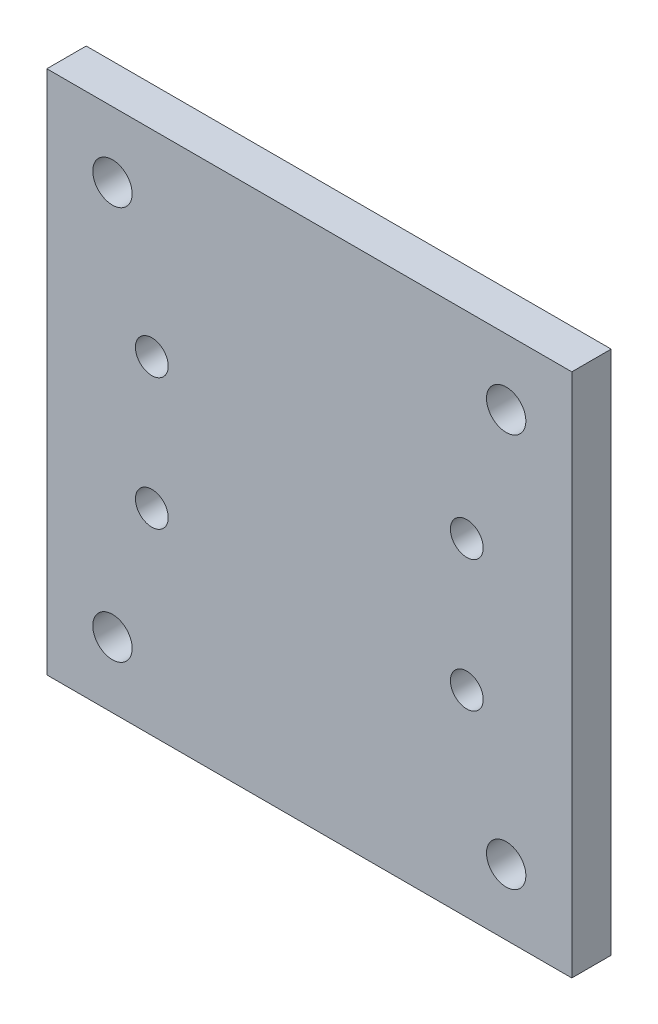
ISO-10303-21;
HEADER;
FILE_DESCRIPTION(('STEP AP214'),'2;1');
FILE_NAME('part.step','',(''),(''),'','','');
FILE_SCHEMA(('AUTOMOTIVE_DESIGN { 1 0 10303 214 1 1 1 1 }'));
ENDSEC;
DATA;
#1=APPLICATION_CONTEXT('core data for automotive mechanical design processes');
#2=APPLICATION_PROTOCOL_DEFINITION('international standard','automotive_design',2000,#1);
#3=PRODUCT_CONTEXT('',#1,'mechanical');
#4=PRODUCT('Part','Part','',(#3));
#5=PRODUCT_RELATED_PRODUCT_CATEGORY('part','',(#4));
#6=PRODUCT_DEFINITION_FORMATION('','',#4);
#7=PRODUCT_DEFINITION_CONTEXT('part definition',#1,'design');
#8=PRODUCT_DEFINITION('design','',#6,#7);
#9=PRODUCT_DEFINITION_SHAPE('','',#8);
#10=(LENGTH_UNIT() NAMED_UNIT(*) SI_UNIT(.MILLI.,.METRE.));
#11=(NAMED_UNIT(*) PLANE_ANGLE_UNIT() SI_UNIT($,.RADIAN.));
#12=(NAMED_UNIT(*) SI_UNIT($,.STERADIAN.) SOLID_ANGLE_UNIT());
#13=UNCERTAINTY_MEASURE_WITH_UNIT(LENGTH_MEASURE(1.E-05),#10,'distance_accuracy_value','');
#14=(GEOMETRIC_REPRESENTATION_CONTEXT(3) GLOBAL_UNCERTAINTY_ASSIGNED_CONTEXT((#13)) GLOBAL_UNIT_ASSIGNED_CONTEXT((#10,
#11,#12)) REPRESENTATION_CONTEXT('',''));
#15=CARTESIAN_POINT('',(0.,0.,0.));
#16=DIRECTION('',(0.,0.,1.));
#17=DIRECTION('',(1.,0.,0.));
#18=AXIS2_PLACEMENT_3D('',#15,#16,#17);
#19=CARTESIAN_POINT('',(20.,20.,3.));
#20=DIRECTION('',(0.,0.,-1.));
#21=DIRECTION('',(-1.,0.,0.));
#22=AXIS2_PLACEMENT_3D('',#19,#20,#21);
#23=PLANE('',#22);
#24=CARTESIAN_POINT('',(12.,-5.,3.));
#25=DIRECTION('',(0.,0.,1.));
#26=DIRECTION('',(1.,0.,0.));
#27=AXIS2_PLACEMENT_3D('',#24,#25,#26);
#28=CIRCLE('',#27,1.25);
#29=CARTESIAN_POINT('',(13.25,-5.,3.));
#30=VERTEX_POINT('',#29);
#31=EDGE_CURVE('E145',#30,#30,#28,.T.);
#32=ORIENTED_EDGE('',*,*,#31,.F.);
#33=EDGE_LOOP('',(#32));
#34=FACE_BOUND('',#33,.T.);
#35=CARTESIAN_POINT('',(-12.,5.,3.));
#36=DIRECTION('',(0.,0.,1.));
#37=DIRECTION('',(1.,0.,0.));
#38=AXIS2_PLACEMENT_3D('',#35,#36,#37);
#39=CIRCLE('',#38,1.25);
#40=CARTESIAN_POINT('',(-10.75,5.,3.));
#41=VERTEX_POINT('',#40);
#42=EDGE_CURVE('E133',#41,#41,#39,.T.);
#43=ORIENTED_EDGE('',*,*,#42,.F.);
#44=EDGE_LOOP('',(#43));
#45=FACE_BOUND('',#44,.T.);
#46=CARTESIAN_POINT('',(15.,-15.,3.));
#47=DIRECTION('',(0.,0.,1.));
#48=DIRECTION('',(1.,0.,0.));
#49=AXIS2_PLACEMENT_3D('',#46,#47,#48);
#50=CIRCLE('',#49,1.5);
#51=CARTESIAN_POINT('',(16.5,-15.,3.));
#52=VERTEX_POINT('',#51);
#53=EDGE_CURVE('E121',#52,#52,#50,.T.);
#54=ORIENTED_EDGE('',*,*,#53,.F.);
#55=EDGE_LOOP('',(#54));
#56=FACE_BOUND('',#55,.T.);
#57=CARTESIAN_POINT('',(-15.,15.,3.));
#58=DIRECTION('',(0.,0.,1.));
#59=DIRECTION('',(1.,0.,0.));
#60=AXIS2_PLACEMENT_3D('',#57,#58,#59);
#61=CIRCLE('',#60,1.5);
#62=CARTESIAN_POINT('',(-13.5,15.,3.));
#63=VERTEX_POINT('',#62);
#64=EDGE_CURVE('E100',#63,#63,#61,.T.);
#65=ORIENTED_EDGE('',*,*,#64,.F.);
#66=EDGE_LOOP('',(#65));
#67=FACE_BOUND('',#66,.T.);
#68=DIRECTION('',(0.,1.,0.));
#69=VECTOR('',#68,1.);
#70=CARTESIAN_POINT('',(20.,-20.,3.));
#71=LINE('',#70,#69);
#72=CARTESIAN_POINT('',(20.,-20.,3.));
#73=VERTEX_POINT('',#72);
#74=CARTESIAN_POINT('',(20.,20.,3.));
#75=VERTEX_POINT('',#74);
#76=EDGE_CURVE('E85',#73,#75,#71,.T.);
#77=ORIENTED_EDGE('',*,*,#76,.T.);
#78=DIRECTION('',(-1.,0.,0.));
#79=VECTOR('',#78,1.);
#80=CARTESIAN_POINT('',(-20.,20.,3.));
#81=LINE('',#80,#79);
#82=CARTESIAN_POINT('',(-20.,20.,3.));
#83=VERTEX_POINT('',#82);
#84=EDGE_CURVE('E80',#75,#83,#81,.T.);
#85=ORIENTED_EDGE('',*,*,#84,.T.);
#86=DIRECTION('',(0.,-1.,0.));
#87=VECTOR('',#86,1.);
#88=CARTESIAN_POINT('',(-20.,-20.,3.));
#89=LINE('',#88,#87);
#90=CARTESIAN_POINT('',(-20.,-20.,3.));
#91=VERTEX_POINT('',#90);
#92=EDGE_CURVE('E83',#83,#91,#89,.T.);
#93=ORIENTED_EDGE('',*,*,#92,.T.);
#94=DIRECTION('',(1.,0.,0.));
#95=VECTOR('',#94,1.);
#96=CARTESIAN_POINT('',(-20.,-20.,3.));
#97=LINE('',#96,#95);
#98=EDGE_CURVE('E50',#91,#73,#97,.T.);
#99=ORIENTED_EDGE('',*,*,#98,.T.);
#100=EDGE_LOOP('',(#77,#85,#93,#99));
#101=FACE_BOUND('',#100,.T.);
#102=CARTESIAN_POINT('',(15.,15.,3.));
#103=DIRECTION('',(0.,0.,1.));
#104=DIRECTION('',(-1.,0.,0.));
#105=AXIS2_PLACEMENT_3D('',#102,#103,#104);
#106=CIRCLE('',#105,1.5);
#107=CARTESIAN_POINT('',(13.5,15.,3.));
#108=VERTEX_POINT('',#107);
#109=EDGE_CURVE('E115',#108,#108,#106,.T.);
#110=ORIENTED_EDGE('',*,*,#109,.F.);
#111=EDGE_LOOP('',(#110));
#112=FACE_BOUND('',#111,.T.);
#113=CARTESIAN_POINT('',(-15.,-15.,3.));
#114=DIRECTION('',(0.,0.,1.));
#115=DIRECTION('',(-1.,0.,0.));
#116=AXIS2_PLACEMENT_3D('',#113,#114,#115);
#117=CIRCLE('',#116,1.5);
#118=CARTESIAN_POINT('',(-16.5,-15.,3.));
#119=VERTEX_POINT('',#118);
#120=EDGE_CURVE('E127',#119,#119,#117,.T.);
#121=ORIENTED_EDGE('',*,*,#120,.F.);
#122=EDGE_LOOP('',(#121));
#123=FACE_BOUND('',#122,.T.);
#124=CARTESIAN_POINT('',(-12.,-5.,3.));
#125=DIRECTION('',(0.,0.,1.));
#126=DIRECTION('',(-1.,0.,0.));
#127=AXIS2_PLACEMENT_3D('',#124,#125,#126);
#128=CIRCLE('',#127,1.25);
#129=CARTESIAN_POINT('',(-13.25,-5.,3.));
#130=VERTEX_POINT('',#129);
#131=EDGE_CURVE('E139',#130,#130,#128,.T.);
#132=ORIENTED_EDGE('',*,*,#131,.F.);
#133=EDGE_LOOP('',(#132));
#134=FACE_BOUND('',#133,.T.);
#135=CARTESIAN_POINT('',(12.,5.,3.));
#136=DIRECTION('',(0.,0.,1.));
#137=DIRECTION('',(-1.,0.,0.));
#138=AXIS2_PLACEMENT_3D('',#135,#136,#137);
#139=CIRCLE('',#138,1.25);
#140=CARTESIAN_POINT('',(10.75,5.,3.));
#141=VERTEX_POINT('',#140);
#142=EDGE_CURVE('E151',#141,#141,#139,.T.);
#143=ORIENTED_EDGE('',*,*,#142,.F.);
#144=EDGE_LOOP('',(#143));
#145=FACE_BOUND('',#144,.T.);
#146=ADVANCED_FACE('F33',(#34,#45,#56,#67,#101,#112,#123,#134,#145),#23,.F.);
#147=CARTESIAN_POINT('',(20.,20.,0.));
#148=DIRECTION('',(0.,0.,-1.));
#149=DIRECTION('',(-1.,0.,0.));
#150=AXIS2_PLACEMENT_3D('',#147,#148,#149);
#151=PLANE('',#150);
#152=CARTESIAN_POINT('',(12.,-5.,0.));
#153=DIRECTION('',(0.,0.,1.));
#154=DIRECTION('',(1.,0.,0.));
#155=AXIS2_PLACEMENT_3D('',#152,#153,#154);
#156=CIRCLE('',#155,1.25);
#157=CARTESIAN_POINT('',(13.25,-5.,0.));
#158=VERTEX_POINT('',#157);
#159=EDGE_CURVE('E148',#158,#158,#156,.T.);
#160=ORIENTED_EDGE('',*,*,#159,.T.);
#161=EDGE_LOOP('',(#160));
#162=FACE_BOUND('',#161,.T.);
#163=CARTESIAN_POINT('',(-12.,5.,0.));
#164=DIRECTION('',(0.,0.,1.));
#165=DIRECTION('',(1.,0.,0.));
#166=AXIS2_PLACEMENT_3D('',#163,#164,#165);
#167=CIRCLE('',#166,1.25);
#168=CARTESIAN_POINT('',(-10.75,5.,0.));
#169=VERTEX_POINT('',#168);
#170=EDGE_CURVE('E136',#169,#169,#167,.T.);
#171=ORIENTED_EDGE('',*,*,#170,.T.);
#172=EDGE_LOOP('',(#171));
#173=FACE_BOUND('',#172,.T.);
#174=CARTESIAN_POINT('',(15.,-15.,0.));
#175=DIRECTION('',(0.,0.,1.));
#176=DIRECTION('',(1.,0.,0.));
#177=AXIS2_PLACEMENT_3D('',#174,#175,#176);
#178=CIRCLE('',#177,1.5);
#179=CARTESIAN_POINT('',(16.5,-15.,0.));
#180=VERTEX_POINT('',#179);
#181=EDGE_CURVE('E124',#180,#180,#178,.T.);
#182=ORIENTED_EDGE('',*,*,#181,.T.);
#183=EDGE_LOOP('',(#182));
#184=FACE_BOUND('',#183,.T.);
#185=CARTESIAN_POINT('',(-15.,15.,0.));
#186=DIRECTION('',(0.,0.,1.));
#187=DIRECTION('',(1.,0.,0.));
#188=AXIS2_PLACEMENT_3D('',#185,#186,#187);
#189=CIRCLE('',#188,1.5);
#190=CARTESIAN_POINT('',(-13.5,15.,0.));
#191=VERTEX_POINT('',#190);
#192=EDGE_CURVE('E112',#191,#191,#189,.T.);
#193=ORIENTED_EDGE('',*,*,#192,.T.);
#194=EDGE_LOOP('',(#193));
#195=FACE_BOUND('',#194,.T.);
#196=DIRECTION('',(0.,1.,0.));
#197=VECTOR('',#196,1.);
#198=CARTESIAN_POINT('',(20.,-20.,0.));
#199=LINE('',#198,#197);
#200=CARTESIAN_POINT('',(20.,-20.,0.));
#201=VERTEX_POINT('',#200);
#202=CARTESIAN_POINT('',(20.,20.,0.));
#203=VERTEX_POINT('',#202);
#204=EDGE_CURVE('E97',#201,#203,#199,.T.);
#205=ORIENTED_EDGE('',*,*,#204,.F.);
#206=DIRECTION('',(1.,0.,0.));
#207=VECTOR('',#206,1.);
#208=CARTESIAN_POINT('',(-20.,-20.,0.));
#209=LINE('',#208,#207);
#210=CARTESIAN_POINT('',(-20.,-20.,0.));
#211=VERTEX_POINT('',#210);
#212=EDGE_CURVE('E73',#211,#201,#209,.T.);
#213=ORIENTED_EDGE('',*,*,#212,.F.);
#214=DIRECTION('',(0.,-1.,0.));
#215=VECTOR('',#214,1.);
#216=CARTESIAN_POINT('',(-20.,-20.,0.));
#217=LINE('',#216,#215);
#218=CARTESIAN_POINT('',(-20.,20.,0.));
#219=VERTEX_POINT('',#218);
#220=EDGE_CURVE('E67',#219,#211,#217,.T.);
#221=ORIENTED_EDGE('',*,*,#220,.F.);
#222=DIRECTION('',(-1.,0.,0.));
#223=VECTOR('',#222,1.);
#224=CARTESIAN_POINT('',(-20.,20.,0.));
#225=LINE('',#224,#223);
#226=EDGE_CURVE('E89',#203,#219,#225,.T.);
#227=ORIENTED_EDGE('',*,*,#226,.F.);
#228=EDGE_LOOP('',(#205,#213,#221,#227));
#229=FACE_BOUND('',#228,.T.);
#230=CARTESIAN_POINT('',(15.,15.,0.));
#231=DIRECTION('',(0.,0.,1.));
#232=DIRECTION('',(-1.,0.,0.));
#233=AXIS2_PLACEMENT_3D('',#230,#231,#232);
#234=CIRCLE('',#233,1.5);
#235=CARTESIAN_POINT('',(13.5,15.,0.));
#236=VERTEX_POINT('',#235);
#237=EDGE_CURVE('E118',#236,#236,#234,.T.);
#238=ORIENTED_EDGE('',*,*,#237,.T.);
#239=EDGE_LOOP('',(#238));
#240=FACE_BOUND('',#239,.T.);
#241=CARTESIAN_POINT('',(-15.,-15.,0.));
#242=DIRECTION('',(0.,0.,1.));
#243=DIRECTION('',(-1.,0.,0.));
#244=AXIS2_PLACEMENT_3D('',#241,#242,#243);
#245=CIRCLE('',#244,1.5);
#246=CARTESIAN_POINT('',(-16.5,-15.,0.));
#247=VERTEX_POINT('',#246);
#248=EDGE_CURVE('E130',#247,#247,#245,.T.);
#249=ORIENTED_EDGE('',*,*,#248,.T.);
#250=EDGE_LOOP('',(#249));
#251=FACE_BOUND('',#250,.T.);
#252=CARTESIAN_POINT('',(-12.,-5.,0.));
#253=DIRECTION('',(0.,0.,1.));
#254=DIRECTION('',(-1.,0.,0.));
#255=AXIS2_PLACEMENT_3D('',#252,#253,#254);
#256=CIRCLE('',#255,1.25);
#257=CARTESIAN_POINT('',(-13.25,-5.,0.));
#258=VERTEX_POINT('',#257);
#259=EDGE_CURVE('E142',#258,#258,#256,.T.);
#260=ORIENTED_EDGE('',*,*,#259,.T.);
#261=EDGE_LOOP('',(#260));
#262=FACE_BOUND('',#261,.T.);
#263=CARTESIAN_POINT('',(12.,5.,0.));
#264=DIRECTION('',(0.,0.,1.));
#265=DIRECTION('',(-1.,0.,0.));
#266=AXIS2_PLACEMENT_3D('',#263,#264,#265);
#267=CIRCLE('',#266,1.25);
#268=CARTESIAN_POINT('',(10.75,5.,0.));
#269=VERTEX_POINT('',#268);
#270=EDGE_CURVE('E154',#269,#269,#267,.T.);
#271=ORIENTED_EDGE('',*,*,#270,.T.);
#272=EDGE_LOOP('',(#271));
#273=FACE_BOUND('',#272,.T.);
#274=ADVANCED_FACE('F108',(#162,#173,#184,#195,#229,#240,#251,#262,#273),#151,.T.);
#275=CARTESIAN_POINT('',(20.,-20.,3.));
#276=DIRECTION('',(-1.,0.,0.));
#277=DIRECTION('',(0.,0.,1.));
#278=AXIS2_PLACEMENT_3D('',#275,#276,#277);
#279=PLANE('',#278);
#280=ORIENTED_EDGE('',*,*,#204,.T.);
#281=DIRECTION('',(0.,0.,-1.));
#282=VECTOR('',#281,1.);
#283=CARTESIAN_POINT('',(20.,20.,3.));
#284=LINE('',#283,#282);
#285=EDGE_CURVE('E11',#75,#203,#284,.T.);
#286=ORIENTED_EDGE('',*,*,#285,.F.);
#287=ORIENTED_EDGE('',*,*,#76,.F.);
#288=DIRECTION('',(0.,0.,-1.));
#289=VECTOR('',#288,1.);
#290=CARTESIAN_POINT('',(20.,-20.,3.));
#291=LINE('',#290,#289);
#292=EDGE_CURVE('E93',#73,#201,#291,.T.);
#293=ORIENTED_EDGE('',*,*,#292,.T.);
#294=EDGE_LOOP('',(#280,#286,#287,#293));
#295=FACE_BOUND('',#294,.T.);
#296=ADVANCED_FACE('F35',(#295),#279,.F.);
#297=CARTESIAN_POINT('',(-20.,20.,3.));
#298=DIRECTION('',(0.,-1.,0.));
#299=DIRECTION('',(0.,0.,-1.));
#300=AXIS2_PLACEMENT_3D('',#297,#298,#299);
#301=PLANE('',#300);
#302=ORIENTED_EDGE('',*,*,#226,.T.);
#303=DIRECTION('',(0.,0.,-1.));
#304=VECTOR('',#303,1.);
#305=CARTESIAN_POINT('',(-20.,20.,3.));
#306=LINE('',#305,#304);
#307=EDGE_CURVE('E42',#83,#219,#306,.T.);
#308=ORIENTED_EDGE('',*,*,#307,.F.);
#309=ORIENTED_EDGE('',*,*,#84,.F.);
#310=ORIENTED_EDGE('',*,*,#285,.T.);
#311=EDGE_LOOP('',(#302,#308,#309,#310));
#312=FACE_BOUND('',#311,.T.);
#313=ADVANCED_FACE('F88',(#312),#301,.F.);
#314=CARTESIAN_POINT('',(-20.,-20.,3.));
#315=DIRECTION('',(1.,0.,0.));
#316=DIRECTION('',(0.,0.,-1.));
#317=AXIS2_PLACEMENT_3D('',#314,#315,#316);
#318=PLANE('',#317);
#319=ORIENTED_EDGE('',*,*,#220,.T.);
#320=DIRECTION('',(0.,0.,-1.));
#321=VECTOR('',#320,1.);
#322=CARTESIAN_POINT('',(-20.,-20.,3.));
#323=LINE('',#322,#321);
#324=EDGE_CURVE('E90',#91,#211,#323,.T.);
#325=ORIENTED_EDGE('',*,*,#324,.F.);
#326=ORIENTED_EDGE('',*,*,#92,.F.);
#327=ORIENTED_EDGE('',*,*,#307,.T.);
#328=EDGE_LOOP('',(#319,#325,#326,#327));
#329=FACE_BOUND('',#328,.T.);
#330=ADVANCED_FACE('F91',(#329),#318,.F.);
#331=CARTESIAN_POINT('',(-20.,-20.,3.));
#332=DIRECTION('',(0.,1.,0.));
#333=DIRECTION('',(0.,0.,1.));
#334=AXIS2_PLACEMENT_3D('',#331,#332,#333);
#335=PLANE('',#334);
#336=ORIENTED_EDGE('',*,*,#212,.T.);
#337=ORIENTED_EDGE('',*,*,#292,.F.);
#338=ORIENTED_EDGE('',*,*,#98,.F.);
#339=ORIENTED_EDGE('',*,*,#324,.T.);
#340=EDGE_LOOP('',(#336,#337,#338,#339));
#341=FACE_BOUND('',#340,.T.);
#342=ADVANCED_FACE('F105',(#341),#335,.F.);
#343=CARTESIAN_POINT('',(-15.,15.,3.));
#344=DIRECTION('',(0.,0.,-1.));
#345=DIRECTION('',(-1.,0.,0.));
#346=AXIS2_PLACEMENT_3D('',#343,#344,#345);
#347=CYLINDRICAL_SURFACE('',#346,1.5);
#348=ORIENTED_EDGE('',*,*,#64,.T.);
#349=EDGE_LOOP('',(#348));
#350=FACE_BOUND('',#349,.T.);
#351=ORIENTED_EDGE('',*,*,#192,.F.);
#352=EDGE_LOOP('',(#351));
#353=FACE_BOUND('',#352,.T.);
#354=ADVANCED_FACE('F174',(#350,#353),#347,.F.);
#355=CARTESIAN_POINT('',(15.,15.,3.));
#356=DIRECTION('',(0.,0.,-1.));
#357=DIRECTION('',(-1.,0.,0.));
#358=AXIS2_PLACEMENT_3D('',#355,#356,#357);
#359=CYLINDRICAL_SURFACE('',#358,1.5);
#360=ORIENTED_EDGE('',*,*,#109,.T.);
#361=EDGE_LOOP('',(#360));
#362=FACE_BOUND('',#361,.T.);
#363=ORIENTED_EDGE('',*,*,#237,.F.);
#364=EDGE_LOOP('',(#363));
#365=FACE_BOUND('',#364,.T.);
#366=ADVANCED_FACE('F220',(#362,#365),#359,.F.);
#367=CARTESIAN_POINT('',(15.,-15.,3.));
#368=DIRECTION('',(0.,0.,-1.));
#369=DIRECTION('',(-1.,0.,0.));
#370=AXIS2_PLACEMENT_3D('',#367,#368,#369);
#371=CYLINDRICAL_SURFACE('',#370,1.5);
#372=ORIENTED_EDGE('',*,*,#53,.T.);
#373=EDGE_LOOP('',(#372));
#374=FACE_BOUND('',#373,.T.);
#375=ORIENTED_EDGE('',*,*,#181,.F.);
#376=EDGE_LOOP('',(#375));
#377=FACE_BOUND('',#376,.T.);
#378=ADVANCED_FACE('F228',(#374,#377),#371,.F.);
#379=CARTESIAN_POINT('',(-15.,-15.,3.));
#380=DIRECTION('',(0.,0.,-1.));
#381=DIRECTION('',(-1.,0.,0.));
#382=AXIS2_PLACEMENT_3D('',#379,#380,#381);
#383=CYLINDRICAL_SURFACE('',#382,1.5);
#384=ORIENTED_EDGE('',*,*,#120,.T.);
#385=EDGE_LOOP('',(#384));
#386=FACE_BOUND('',#385,.T.);
#387=ORIENTED_EDGE('',*,*,#248,.F.);
#388=EDGE_LOOP('',(#387));
#389=FACE_BOUND('',#388,.T.);
#390=ADVANCED_FACE('F236',(#386,#389),#383,.F.);
#391=CARTESIAN_POINT('',(-12.,5.,3.));
#392=DIRECTION('',(0.,0.,-1.));
#393=DIRECTION('',(-1.,0.,0.));
#394=AXIS2_PLACEMENT_3D('',#391,#392,#393);
#395=CYLINDRICAL_SURFACE('',#394,1.25);
#396=ORIENTED_EDGE('',*,*,#42,.T.);
#397=EDGE_LOOP('',(#396));
#398=FACE_BOUND('',#397,.T.);
#399=ORIENTED_EDGE('',*,*,#170,.F.);
#400=EDGE_LOOP('',(#399));
#401=FACE_BOUND('',#400,.T.);
#402=ADVANCED_FACE('F245',(#398,#401),#395,.F.);
#403=CARTESIAN_POINT('',(-12.,-5.,3.));
#404=DIRECTION('',(0.,0.,-1.));
#405=DIRECTION('',(-1.,0.,0.));
#406=AXIS2_PLACEMENT_3D('',#403,#404,#405);
#407=CYLINDRICAL_SURFACE('',#406,1.25);
#408=ORIENTED_EDGE('',*,*,#131,.T.);
#409=EDGE_LOOP('',(#408));
#410=FACE_BOUND('',#409,.T.);
#411=ORIENTED_EDGE('',*,*,#259,.F.);
#412=EDGE_LOOP('',(#411));
#413=FACE_BOUND('',#412,.T.);
#414=ADVANCED_FACE('F254',(#410,#413),#407,.F.);
#415=CARTESIAN_POINT('',(12.,-5.,3.));
#416=DIRECTION('',(0.,0.,-1.));
#417=DIRECTION('',(-1.,0.,0.));
#418=AXIS2_PLACEMENT_3D('',#415,#416,#417);
#419=CYLINDRICAL_SURFACE('',#418,1.25);
#420=ORIENTED_EDGE('',*,*,#31,.T.);
#421=EDGE_LOOP('',(#420));
#422=FACE_BOUND('',#421,.T.);
#423=ORIENTED_EDGE('',*,*,#159,.F.);
#424=EDGE_LOOP('',(#423));
#425=FACE_BOUND('',#424,.T.);
#426=ADVANCED_FACE('F263',(#422,#425),#419,.F.);
#427=CARTESIAN_POINT('',(12.,5.,3.));
#428=DIRECTION('',(0.,0.,-1.));
#429=DIRECTION('',(-1.,0.,0.));
#430=AXIS2_PLACEMENT_3D('',#427,#428,#429);
#431=CYLINDRICAL_SURFACE('',#430,1.25);
#432=ORIENTED_EDGE('',*,*,#142,.T.);
#433=EDGE_LOOP('',(#432));
#434=FACE_BOUND('',#433,.T.);
#435=ORIENTED_EDGE('',*,*,#270,.F.);
#436=EDGE_LOOP('',(#435));
#437=FACE_BOUND('',#436,.T.);
#438=ADVANCED_FACE('F160',(#434,#437),#431,.F.);
#439=CLOSED_SHELL('',(#146,#274,#296,#313,#330,#342,#354,#366,#378,#390,#402,#414,#426,#438));
#440=MANIFOLD_SOLID_BREP('B2',#439);
#441=ADVANCED_BREP_SHAPE_REPRESENTATION('',(#18,#440),#14);
#442=SHAPE_DEFINITION_REPRESENTATION(#9,#441);
ENDSEC;
END-ISO-10303-21;
